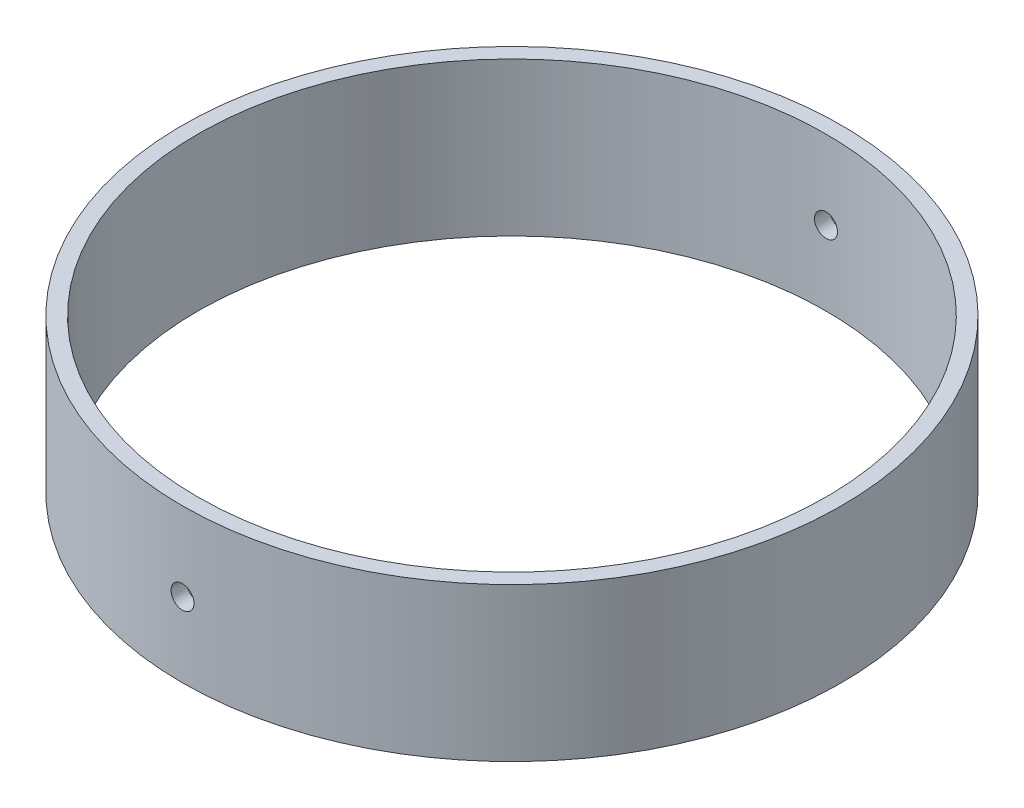
ISO-10303-21;
HEADER;
FILE_DESCRIPTION(('STEP AP214'),'2;1');
FILE_NAME('part.step','',(''),(''),'','','');
FILE_SCHEMA(('AUTOMOTIVE_DESIGN { 1 0 10303 214 1 1 1 1 }'));
ENDSEC;
DATA;
#1=APPLICATION_CONTEXT('core data for automotive mechanical design processes');
#2=APPLICATION_PROTOCOL_DEFINITION('international standard','automotive_design',2000,#1);
#3=PRODUCT_CONTEXT('',#1,'mechanical');
#4=PRODUCT('Part','Part','',(#3));
#5=PRODUCT_RELATED_PRODUCT_CATEGORY('part','',(#4));
#6=PRODUCT_DEFINITION_FORMATION('','',#4);
#7=PRODUCT_DEFINITION_CONTEXT('part definition',#1,'design');
#8=PRODUCT_DEFINITION('design','',#6,#7);
#9=PRODUCT_DEFINITION_SHAPE('','',#8);
#10=(LENGTH_UNIT() NAMED_UNIT(*) SI_UNIT(.MILLI.,.METRE.));
#11=(NAMED_UNIT(*) PLANE_ANGLE_UNIT() SI_UNIT($,.RADIAN.));
#12=(NAMED_UNIT(*) SI_UNIT($,.STERADIAN.) SOLID_ANGLE_UNIT());
#13=UNCERTAINTY_MEASURE_WITH_UNIT(LENGTH_MEASURE(1.E-05),#10,'distance_accuracy_value','');
#14=(GEOMETRIC_REPRESENTATION_CONTEXT(3) GLOBAL_UNCERTAINTY_ASSIGNED_CONTEXT((#13)) GLOBAL_UNIT_ASSIGNED_CONTEXT((#10,
#11,#12)) REPRESENTATION_CONTEXT('',''));
#15=CARTESIAN_POINT('',(0.,0.,0.));
#16=DIRECTION('',(0.,0.,1.));
#17=DIRECTION('',(1.,0.,0.));
#18=AXIS2_PLACEMENT_3D('',#15,#16,#17);
#19=CARTESIAN_POINT('',(0.,25.4,0.));
#20=DIRECTION('',(0.,-1.,0.));
#21=DIRECTION('',(0.,0.,-1.));
#22=AXIS2_PLACEMENT_3D('',#19,#20,#21);
#23=CYLINDRICAL_SURFACE('',#22,54.61);
#24=CARTESIAN_POINT('',(0.,25.4,0.));
#25=DIRECTION('',(0.,1.,0.));
#26=DIRECTION('',(0.,0.,1.));
#27=AXIS2_PLACEMENT_3D('',#24,#25,#26);
#28=CIRCLE('',#27,54.61);
#29=CARTESIAN_POINT('',(0.,25.4,54.61));
#30=VERTEX_POINT('',#29);
#31=EDGE_CURVE('E10',#30,#30,#28,.T.);
#32=ORIENTED_EDGE('',*,*,#31,.F.);
#33=EDGE_LOOP('',(#32));
#34=FACE_BOUND('',#33,.T.);
#35=CARTESIAN_POINT('',(0.,0.,0.));
#36=DIRECTION('',(0.,1.,0.));
#37=DIRECTION('',(0.,0.,1.));
#38=AXIS2_PLACEMENT_3D('',#35,#36,#37);
#39=CIRCLE('',#38,54.61);
#40=CARTESIAN_POINT('',(0.,0.,54.61));
#41=VERTEX_POINT('',#40);
#42=EDGE_CURVE('E44',#41,#41,#39,.T.);
#43=ORIENTED_EDGE('',*,*,#42,.T.);
#44=EDGE_LOOP('',(#43));
#45=FACE_BOUND('',#44,.T.);
#46=CARTESIAN_POINT('',(0.,10.4239555269859,54.61));
#47=CARTESIAN_POINT('',(0.106969775627343,10.4239602599121,54.6099995529571));
#48=CARTESIAN_POINT('',(0.214016285777394,10.4329956416153,54.6096823316829));
#49=CARTESIAN_POINT('',(0.425158795307455,10.4689128482885,54.608447368905));
#50=CARTESIAN_POINT('',(0.52925112556797,10.4958159334483,54.6075289120296));
#51=CARTESIAN_POINT('',(0.731395950473661,10.5666995988189,54.6051954791821));
#52=CARTESIAN_POINT('',(0.829451396653879,10.6106717556031,54.6037807481497));
#53=CARTESIAN_POINT('',(1.01676171214993,10.7144330998902,54.6006142968803));
#54=CARTESIAN_POINT('',(1.10601870854792,10.7742184515143,54.5988626583965));
#55=CARTESIAN_POINT('',(1.27327623468102,10.9079480611374,54.595218479672));
#56=CARTESIAN_POINT('',(1.35127129184676,10.981899162431,54.5933258716019));
#57=CARTESIAN_POINT('',(1.49374470053449,11.1418485181315,54.5896136565972));
#58=CARTESIAN_POINT('',(1.55822251103852,11.2278472545065,54.5877940525868));
#59=CARTESIAN_POINT('',(1.67184201742921,11.4094739988082,54.5844326497573));
#60=CARTESIAN_POINT('',(1.72098007826895,11.5051042820239,54.5828909168215));
#61=CARTESIAN_POINT('',(1.80250171780979,11.7032633842901,54.580259807431));
#62=CARTESIAN_POINT('',(1.83488537555516,11.8057921707921,54.5791704288421));
#63=CARTESIAN_POINT('',(1.88196623483984,12.0147933143339,54.5775674030549));
#64=CARTESIAN_POINT('',(1.89667068923612,12.1212640357115,54.5770535197666));
#65=CARTESIAN_POINT('',(1.90799809069456,12.3351638303227,54.5766587189544));
#66=CARTESIAN_POINT('',(1.90462112389026,12.4425928989887,54.5767777984151));
#67=CARTESIAN_POINT('',(1.87988764209952,12.6553106574942,54.577635275006));
#68=CARTESIAN_POINT('',(1.85853896320751,12.7606002597038,54.5783734022162));
#69=CARTESIAN_POINT('',(1.79848019551148,12.9661002369379,54.5803853434239));
#70=CARTESIAN_POINT('',(1.75977006150685,13.0663105987378,54.5816591588161));
#71=CARTESIAN_POINT('',(1.66607823603268,13.2588327254405,54.5845991971315));
#72=CARTESIAN_POINT('',(1.6110929564523,13.3511427427972,54.5862655065696));
#73=CARTESIAN_POINT('',(1.48641432024243,13.5252246823535,54.5898026067403));
#74=CARTESIAN_POINT('',(1.4167209160937,13.606996570505,54.5916733981335));
#75=CARTESIAN_POINT('',(1.26456006729128,13.7577266844407,54.5954097769148));
#76=CARTESIAN_POINT('',(1.18208583036259,13.8266780537461,54.5972753609957));
#77=CARTESIAN_POINT('',(1.00672840008933,13.9497570524933,54.6007900626657));
#78=CARTESIAN_POINT('',(0.913845204914098,14.003884679328,54.6024391802168));
#79=CARTESIAN_POINT('',(0.720302624519637,14.0957789618525,54.6053350891605));
#80=CARTESIAN_POINT('',(0.61964313459512,14.1335453971989,54.6065818751347));
#81=CARTESIAN_POINT('',(0.4134070526955,14.1916408455937,54.6085324969699));
#82=CARTESIAN_POINT('',(0.307830478743623,14.2119699225522,54.609236334821));
#83=CARTESIAN_POINT('',(0.0948167356045886,14.2346051735236,54.610021469043));
#84=CARTESIAN_POINT('',(-0.0126194243657498,14.2369208341309,54.6101030930966));
#85=CARTESIAN_POINT('',(-0.226354938776963,14.2234882479484,54.6096354675401));
#86=CARTESIAN_POINT('',(-0.332654295017761,14.2077400297638,54.6090862189291));
#87=CARTESIAN_POINT('',(-0.541072271659497,14.1586345722743,54.6074189526073));
#88=CARTESIAN_POINT('',(-0.643191909265567,14.1252816451613,54.606301074182));
#89=CARTESIAN_POINT('',(-0.840382893964743,14.0419179126559,54.6036224941728));
#90=CARTESIAN_POINT('',(-0.935454221633547,13.9919070613582,54.6020617913684));
#91=CARTESIAN_POINT('',(-1.11589350123285,13.876622705868,54.5986725126272));
#92=CARTESIAN_POINT('',(-1.20125737498798,13.8113428219848,54.5968438248408));
#93=CARTESIAN_POINT('',(-1.35981760983991,13.6673828168347,54.5931250135553));
#94=CARTESIAN_POINT('',(-1.43301393058506,13.5887026511297,54.5912348898524));
#95=CARTESIAN_POINT('',(-1.56519301489747,13.4201348402539,54.5876053454446));
#96=CARTESIAN_POINT('',(-1.62416965425449,13.3302423913148,54.5858659898791));
#97=CARTESIAN_POINT('',(-1.72619338466828,13.1418261826704,54.5827351164865));
#98=CARTESIAN_POINT('',(-1.76924051827669,13.0433024460222,54.5813435977301));
#99=CARTESIAN_POINT('',(-1.83817256143816,12.8404433737013,54.5790657587231));
#100=CARTESIAN_POINT('',(-1.86406142183157,12.7361093818919,54.5781793221794));
#101=CARTESIAN_POINT('',(-1.89795497261171,12.524572480879,54.5770112674852));
#102=CARTESIAN_POINT('',(-1.90595969567723,12.417369576918,54.5767296482294));
#103=CARTESIAN_POINT('',(-1.9038573014907,12.2031991246086,54.5768030222639));
#104=CARTESIAN_POINT('',(-1.89375983430056,12.0962314812794,54.5771576763645));
#105=CARTESIAN_POINT('',(-1.85575956396343,11.8855107461099,54.5784629040581));
#106=CARTESIAN_POINT('',(-1.82785672574385,11.7817576606022,54.579413478825));
#107=CARTESIAN_POINT('',(-1.75503933669187,11.5804081229601,54.58180333285));
#108=CARTESIAN_POINT('',(-1.7101245230023,11.4828117659826,54.5832426196594));
#109=CARTESIAN_POINT('',(-1.6045608055315,11.2965463414836,54.5864475932976));
#110=CARTESIAN_POINT('',(-1.54391245361031,11.2078769609965,54.5882132686775));
#111=CARTESIAN_POINT('',(-1.40857232251474,11.0419365764004,54.5918729816849));
#112=CARTESIAN_POINT('',(-1.33387456925283,10.9646704462181,54.5937670736977));
#113=CARTESIAN_POINT('',(-1.17254589656414,10.8237534674585,54.5974700126265));
#114=CARTESIAN_POINT('',(-1.08591203075166,10.7601059905303,54.5992788383464));
#115=CARTESIAN_POINT('',(-0.903129764902133,10.6482185131034,54.6026081084077));
#116=CARTESIAN_POINT('',(-0.806974662675166,10.5999894683916,54.6041283473794));
#117=CARTESIAN_POINT('',(-0.608000477464156,10.5204160522017,54.6067055723962));
#118=CARTESIAN_POINT('',(-0.505189490476256,10.4890515840214,54.6077631095393));
#119=CARTESIAN_POINT('',(-0.334775953220498,10.4523927368054,54.6090137044382));
#120=CARTESIAN_POINT('',(-0.268279082846069,10.4417422400079,54.6093819563875));
#121=CARTESIAN_POINT('',(-0.134531593647159,10.4275221480815,54.6098752447082));
#122=CARTESIAN_POINT('',(-0.0672809751254226,10.4239525501087,54.6100002811774));
#123=CARTESIAN_POINT('',(0.,10.4239555269859,54.61));
#124=B_SPLINE_CURVE_WITH_KNOTS('',3,(#46,#47,#48,#49,#50,#51,#52,#53,#54,#55,#56,#57,#58,#59,
#60,#61,#62,#63,#64,#65,#66,#67,#68,#69,#70,#71,#72,#73,#74,#75,#76,#77,#78,#79,#80,#81,#82,#83,
#84,#85,#86,#87,#88,#89,#90,#91,#92,#93,#94,#95,#96,#97,#98,#99,#100,#101,#102,#103,#104,#105,
#106,#107,#108,#109,#110,#111,#112,#113,#114,#115,#116,#117,#118,#119,#120,#121,#122,#123),
.UNSPECIFIED.,.T.,.F.,(4,2,2,2,2,2,2,2,2,2,2,2,2,2,2,2,2,2,2,2,2,2,2,2,2,2,2,2,2,2,2,2,2,2,2,2,
2,2,4),(0.,0.320663739375775,0.641709711141668,0.962597450739142,1.28340742240517,
1.60437276595062,1.92535095344858,2.2464051452273,2.5674578223161,2.88837874321022,
3.2092981353511,3.53007767142806,3.85085804266061,4.17170918769463,4.49256136935549,
4.81358465392159,5.13460799494749,5.45563565920209,5.77666214684486,6.09751955748752,
6.41837646003512,6.73915480661652,7.05993403719196,7.38084753556984,7.70176209818219,
8.02281462813049,8.34386630046197,8.66484402217062,8.98582115737217,9.30662723436537,
9.62743394327668,9.94824560927158,10.2690460241921,10.5899831595582,10.9109996594955,
11.2322437578877,11.5531041919902,11.7547927307502,11.9564811885042),.UNSPECIFIED.);
#125=CARTESIAN_POINT('',(0.,10.4239555269859,54.61));
#126=VERTEX_POINT('',#125);
#127=EDGE_CURVE('E60',#126,#126,#124,.T.);
#128=ORIENTED_EDGE('',*,*,#127,.F.);
#129=EDGE_LOOP('',(#128));
#130=FACE_BOUND('',#129,.T.);
#131=CARTESIAN_POINT('',(0.,14.2339555269859,-54.61));
#132=CARTESIAN_POINT('',(0.106969775627343,14.2339507940597,-54.6099995529571));
#133=CARTESIAN_POINT('',(0.214016285777394,14.2249154123566,-54.6096823316829));
#134=CARTESIAN_POINT('',(0.425158795307455,14.1889982056833,-54.608447368905));
#135=CARTESIAN_POINT('',(0.52925112556797,14.1620951205235,-54.6075289120296));
#136=CARTESIAN_POINT('',(0.731395950473661,14.091211455153,-54.6051954791821));
#137=CARTESIAN_POINT('',(0.829451396653879,14.0472392983688,-54.6037807481497));
#138=CARTESIAN_POINT('',(1.01676171214993,13.9434779540817,-54.6006142968803));
#139=CARTESIAN_POINT('',(1.10601870854792,13.8836926024576,-54.5988626583965));
#140=CARTESIAN_POINT('',(1.27327623468102,13.7499629928345,-54.595218479672));
#141=CARTESIAN_POINT('',(1.35127129184676,13.6760118915409,-54.5933258716019));
#142=CARTESIAN_POINT('',(1.49374470053449,13.5160625358404,-54.5896136565972));
#143=CARTESIAN_POINT('',(1.55822251103852,13.4300637994654,-54.5877940525868));
#144=CARTESIAN_POINT('',(1.67184201742921,13.2484370551637,-54.5844326497573));
#145=CARTESIAN_POINT('',(1.72098007826894,13.152806771948,-54.5828909168215));
#146=CARTESIAN_POINT('',(1.80250171780979,12.9546476696817,-54.580259807431));
#147=CARTESIAN_POINT('',(1.83488537555516,12.8521188831798,-54.5791704288421));
#148=CARTESIAN_POINT('',(1.88196623483984,12.643117739638,-54.5775674030549));
#149=CARTESIAN_POINT('',(1.89667068923612,12.5366470182604,-54.5770535197666));
#150=CARTESIAN_POINT('',(1.90799809069456,12.3227472236492,-54.5766587189544));
#151=CARTESIAN_POINT('',(1.90462112389026,12.2153181549832,-54.5767777984151));
#152=CARTESIAN_POINT('',(1.87988764209952,12.0026003964777,-54.577635275006));
#153=CARTESIAN_POINT('',(1.85853896320751,11.8973107942681,-54.5783734022162));
#154=CARTESIAN_POINT('',(1.79848019551148,11.691810817034,-54.5803853434239));
#155=CARTESIAN_POINT('',(1.75977006150685,11.5916004552341,-54.5816591588161));
#156=CARTESIAN_POINT('',(1.66607823603268,11.3990783285314,-54.5845991971315));
#157=CARTESIAN_POINT('',(1.6110929564523,11.3067683111747,-54.5862655065696));
#158=CARTESIAN_POINT('',(1.48641432024243,11.1326863716184,-54.5898026067403));
#159=CARTESIAN_POINT('',(1.4167209160937,11.0509144834669,-54.5916733981335));
#160=CARTESIAN_POINT('',(1.26456006729128,10.9001843695312,-54.5954097769148));
#161=CARTESIAN_POINT('',(1.18208583036259,10.8312330002258,-54.5972753609957));
#162=CARTESIAN_POINT('',(1.00672840008933,10.7081540014785,-54.6007900626657));
#163=CARTESIAN_POINT('',(0.913845204914098,10.6540263746438,-54.6024391802168));
#164=CARTESIAN_POINT('',(0.720302624519637,10.5621320921194,-54.6053350891605));
#165=CARTESIAN_POINT('',(0.61964313459512,10.524365656773,-54.6065818751347));
#166=CARTESIAN_POINT('',(0.4134070526955,10.4662702083782,-54.6085324969699));
#167=CARTESIAN_POINT('',(0.307830478743623,10.4459411314197,-54.609236334821));
#168=CARTESIAN_POINT('',(0.0948167356045886,10.4233058804483,-54.610021469043));
#169=CARTESIAN_POINT('',(-0.0126194243657498,10.420990219841,-54.6101030930966));
#170=CARTESIAN_POINT('',(-0.226354938776963,10.4344228060235,-54.6096354675401));
#171=CARTESIAN_POINT('',(-0.332654295017761,10.4501710242081,-54.6090862189291));
#172=CARTESIAN_POINT('',(-0.541072271659497,10.4992764816976,-54.6074189526073));
#173=CARTESIAN_POINT('',(-0.643191909265566,10.5326294088106,-54.606301074182));
#174=CARTESIAN_POINT('',(-0.840382893964743,10.615993141316,-54.6036224941728));
#175=CARTESIAN_POINT('',(-0.935454221633546,10.6660039926136,-54.6020617913684));
#176=CARTESIAN_POINT('',(-1.11589350123285,10.7812883481038,-54.5986725126272));
#177=CARTESIAN_POINT('',(-1.20125737498798,10.846568231987,-54.5968438248408));
#178=CARTESIAN_POINT('',(-1.35981760983991,10.9905282371372,-54.5931250135553));
#179=CARTESIAN_POINT('',(-1.43301393058506,11.0692084028422,-54.5912348898524));
#180=CARTESIAN_POINT('',(-1.56519301489747,11.237776213718,-54.5876053454446));
#181=CARTESIAN_POINT('',(-1.62416965425449,11.3276686626571,-54.5858659898791));
#182=CARTESIAN_POINT('',(-1.72619338466828,11.5160848713015,-54.5827351164865));
#183=CARTESIAN_POINT('',(-1.76924051827669,11.6146086079496,-54.5813435977301));
#184=CARTESIAN_POINT('',(-1.83817256143816,11.8174676802706,-54.5790657587231));
#185=CARTESIAN_POINT('',(-1.86406142183157,11.9218016720799,-54.5781793221794));
#186=CARTESIAN_POINT('',(-1.89795497261171,12.1333385730929,-54.5770112674852));
#187=CARTESIAN_POINT('',(-1.90595969567723,12.2405414770539,-54.5767296482294));
#188=CARTESIAN_POINT('',(-1.9038573014907,12.4547119293633,-54.5768030222639));
#189=CARTESIAN_POINT('',(-1.89375983430056,12.5616795726925,-54.5771576763645));
#190=CARTESIAN_POINT('',(-1.85575956396343,12.7724003078619,-54.5784629040581));
#191=CARTESIAN_POINT('',(-1.82785672574385,12.8761533933697,-54.579413478825));
#192=CARTESIAN_POINT('',(-1.75503933669187,13.0775029310117,-54.58180333285));
#193=CARTESIAN_POINT('',(-1.7101245230023,13.1750992879893,-54.5832426196594));
#194=CARTESIAN_POINT('',(-1.6045608055315,13.3613647124883,-54.5864475932976));
#195=CARTESIAN_POINT('',(-1.54391245361031,13.4500340929754,-54.5882132686775));
#196=CARTESIAN_POINT('',(-1.40857232251474,13.6159744775715,-54.5918729816849));
#197=CARTESIAN_POINT('',(-1.33387456925283,13.6932406077538,-54.5937670736977));
#198=CARTESIAN_POINT('',(-1.17254589656414,13.8341575865134,-54.5974700126265));
#199=CARTESIAN_POINT('',(-1.08591203075166,13.8978050634416,-54.5992788383464));
#200=CARTESIAN_POINT('',(-0.903129764902133,14.0096925408685,-54.6026081084077));
#201=CARTESIAN_POINT('',(-0.806974662675166,14.0579215855802,-54.6041283473794));
#202=CARTESIAN_POINT('',(-0.608000477464156,14.1374950017702,-54.6067055723962));
#203=CARTESIAN_POINT('',(-0.505189490476256,14.1688594699505,-54.6077631095393));
#204=CARTESIAN_POINT('',(-0.334775953220498,14.2055183171664,-54.6090137044382));
#205=CARTESIAN_POINT('',(-0.268279082846069,14.216168813964,-54.6093819563875));
#206=CARTESIAN_POINT('',(-0.134531593647158,14.2303889058904,-54.6098752447082));
#207=CARTESIAN_POINT('',(-0.0672809751254226,14.2339585038632,-54.6100002811774));
#208=CARTESIAN_POINT('',(0.,14.2339555269859,-54.61));
#209=B_SPLINE_CURVE_WITH_KNOTS('',3,(#131,#132,#133,#134,#135,#136,#137,#138,#139,#140,#141,
#142,#143,#144,#145,#146,#147,#148,#149,#150,#151,#152,#153,#154,#155,#156,#157,#158,#159,#160,
#161,#162,#163,#164,#165,#166,#167,#168,#169,#170,#171,#172,#173,#174,#175,#176,#177,#178,#179,
#180,#181,#182,#183,#184,#185,#186,#187,#188,#189,#190,#191,#192,#193,#194,#195,#196,#197,#198,
#199,#200,#201,#202,#203,#204,#205,#206,#207,#208),.UNSPECIFIED.,.T.,.F.,(4,2,2,2,2,2,2,2,2,2,2,
2,2,2,2,2,2,2,2,2,2,2,2,2,2,2,2,2,2,2,2,2,2,2,2,2,2,2,4),(0.,0.320663739375775,
0.641709711141668,0.962597450739142,1.28340742240517,1.60437276595063,1.92535095344858,
2.2464051452273,2.5674578223161,2.88837874321022,3.2092981353511,3.53007767142806,
3.85085804266061,4.17170918769463,4.49256136935549,4.81358465392159,5.13460799494749,
5.45563565920209,5.77666214684486,6.09751955748752,6.41837646003512,6.73915480661652,
7.05993403719196,7.38084753556984,7.70176209818219,8.0228146281305,8.34386630046197,
8.66484402217062,8.98582115737217,9.30662723436537,9.62743394327668,9.94824560927158,
10.2690460241921,10.5899831595582,10.9109996594955,11.2322437578877,11.5531041919903,
11.7547927307502,11.9564811885042),.UNSPECIFIED.);
#210=CARTESIAN_POINT('',(0.,14.2339555269859,-54.61));
#211=VERTEX_POINT('',#210);
#212=EDGE_CURVE('E61',#211,#211,#209,.T.);
#213=ORIENTED_EDGE('',*,*,#212,.F.);
#214=EDGE_LOOP('',(#213));
#215=FACE_BOUND('',#214,.T.);
#216=ADVANCED_FACE('F31',(#34,#45,#130,#215),#23,.T.);
#217=CARTESIAN_POINT('',(0.,25.4,0.));
#218=DIRECTION('',(0.,-1.,0.));
#219=DIRECTION('',(0.,0.,-1.));
#220=AXIS2_PLACEMENT_3D('',#217,#218,#219);
#221=CYLINDRICAL_SURFACE('',#220,52.07);
#222=CARTESIAN_POINT('',(-1.905,12.3289555269859,52.0351407704447));
#223=CARTESIAN_POINT('',(-1.90499526830546,12.2219892655447,52.0351412402369));
#224=CARTESIAN_POINT('',(-1.89596047776962,12.1149463548565,52.0354741425041));
#225=CARTESIAN_POINT('',(-1.86004575671715,11.9038111870525,52.0367700787376));
#226=CARTESIAN_POINT('',(-1.83314458953048,11.7997225952704,52.0377338625746));
#227=CARTESIAN_POINT('',(-1.76226631970125,11.5975852691021,52.0401822407015));
#228=CARTESIAN_POINT('',(-1.71829766698883,11.4995335737015,52.0416665772362));
#229=CARTESIAN_POINT('',(-1.61454489288832,11.3122300130282,52.0449884774772));
#230=CARTESIAN_POINT('',(-1.55476459724002,11.2229760262482,52.0468259557089));
#231=CARTESIAN_POINT('',(-1.42104379024546,11.0557199379436,52.0506483865065));
#232=CARTESIAN_POINT('',(-1.34709589194841,10.9777237435643,52.0526334156731));
#233=CARTESIAN_POINT('',(-1.18715273755405,10.8352472611447,52.0565265266392));
#234=CARTESIAN_POINT('',(-1.10115699866338,10.7707675150079,52.0584346053511));
#235=CARTESIAN_POINT('',(-0.91953325932436,10.6571418544453,52.0619592225406));
#236=CARTESIAN_POINT('',(-0.823902741629071,10.607999961104,52.0635756845191));
#237=CARTESIAN_POINT('',(-0.625741884410336,10.5264709474708,52.0663341899283));
#238=CARTESIAN_POINT('',(-0.523211579273002,10.4940837436864,52.0674762357231));
#239=CARTESIAN_POINT('',(-0.314210640546689,10.4469974745115,52.0691567232569));
#240=CARTESIAN_POINT('',(-0.207741807262072,10.432290428018,52.0696954373418));
#241=CARTESIAN_POINT('',(0.00615477994340771,10.4209573464483,52.0701094533458));
#242=CARTESIAN_POINT('',(0.113582529015595,10.4243312199992,52.0699847586174));
#243=CARTESIAN_POINT('',(0.326293418097942,10.4490575188441,52.0690862433391));
#244=CARTESIAN_POINT('',(0.431577559766158,10.4704013401045,52.0683127334432));
#245=CARTESIAN_POINT('',(0.637067430308371,10.5304483409631,52.0662041084118));
#246=CARTESIAN_POINT('',(0.737273145225021,10.5691515682683,52.0648689917328));
#247=CARTESIAN_POINT('',(0.929789399866694,10.6628285944799,52.0617870694151));
#248=CARTESIAN_POINT('',(1.0220980222654,10.7178063302868,52.0600401641831));
#249=CARTESIAN_POINT('',(1.19617878841137,10.8424688523771,52.0563314975162));
#250=CARTESIAN_POINT('',(1.27795089427642,10.912153691535,52.0543697353088));
#251=CARTESIAN_POINT('',(1.42868757684808,11.0643010061826,52.0504510378179));
#252=CARTESIAN_POINT('',(1.49764461957624,11.1467709461129,52.0484941060369));
#253=CARTESIAN_POINT('',(1.62073572688196,11.3221211461268,52.0448068504914));
#254=CARTESIAN_POINT('',(1.67486978868543,11.4150014081587,52.0430765267693));
#255=CARTESIAN_POINT('',(1.76677749238383,11.6085400448021,52.0400376848695));
#256=CARTESIAN_POINT('',(1.80455087927111,11.7091985406211,52.0387291732666));
#257=CARTESIAN_POINT('',(1.86266008507773,11.9154343596281,52.0366817736014));
#258=CARTESIAN_POINT('',(1.88299597439383,12.0210116629565,52.0359428832394));
#259=CARTESIAN_POINT('',(1.90564365895596,12.2340225705945,52.0351184629643));
#260=CARTESIAN_POINT('',(1.90796589725788,12.3414550631815,52.0350325544984));
#261=CARTESIAN_POINT('',(1.89454758460457,12.5551843306548,52.0355227973308));
#262=CARTESIAN_POINT('',(1.87880706519658,12.6614811075243,52.0360989474728));
#263=CARTESIAN_POINT('',(1.82971870561021,12.8698923715448,52.037848016264));
#264=CARTESIAN_POINT('',(1.79637562064544,12.972007980186,52.0390207737407));
#265=CARTESIAN_POINT('',(1.71303343659757,13.1691926843952,52.0418307220251));
#266=CARTESIAN_POINT('',(1.66303428669963,13.2642617584644,52.0434679142498));
#267=CARTESIAN_POINT('',(1.54777238067686,13.4447028167908,52.0470231045449));
#268=CARTESIAN_POINT('',(1.48250259593506,13.5300703087363,52.0489412317688));
#269=CARTESIAN_POINT('',(1.33856249602039,13.6886397898603,52.0528416144255));
#270=CARTESIAN_POINT('',(1.25989213257514,13.7618417352136,52.0548238700893));
#271=CARTESIAN_POINT('',(1.0913392762083,13.8940371079189,52.0586301637248));
#272=CARTESIAN_POINT('',(1.00145149767171,13.9530237984203,52.0604541264177));
#273=CARTESIAN_POINT('',(0.813042278677641,14.0550681962755,52.06373716619));
#274=CARTESIAN_POINT('',(0.714520862667973,14.0981259487335,52.0651962443025));
#275=CARTESIAN_POINT('',(0.511666337437637,14.1670784050759,52.0675846892501));
#276=CARTESIAN_POINT('',(0.40733470816635,14.1929774580612,52.0685141903051));
#277=CARTESIAN_POINT('',(0.195800466864161,14.2268915915084,52.0697392421445));
#278=CARTESIAN_POINT('',(0.0885978610955468,14.2349067109761,52.0700347943116));
#279=CARTESIAN_POINT('',(-0.125568094570424,14.2328249694414,52.0699586433936));
#280=CARTESIAN_POINT('',(-0.232531547765919,14.2227387045234,52.069587330674));
#281=CARTESIAN_POINT('',(-0.443245714490134,14.1847623392764,52.0682200453809));
#282=CARTESIAN_POINT('',(-0.546996421727213,14.1568722040838,52.0672240715841));
#283=CARTESIAN_POINT('',(-0.748343202323639,14.0840815873349,52.0647196116998));
#284=CARTESIAN_POINT('',(-0.845939184018161,14.0391808525026,52.0632111179813));
#285=CARTESIAN_POINT('',(-1.03220645151803,13.9336463349088,52.0598515001394));
#286=CARTESIAN_POINT('',(-1.12087804651311,13.873013097468,52.0580003878925));
#287=CARTESIAN_POINT('',(-1.28683033895055,13.7377000720801,52.0541628801186));
#288=CARTESIAN_POINT('',(-1.3641055676894,13.6630135793539,52.0521764203072));
#289=CARTESIAN_POINT('',(-1.50504276040354,13.5017057782561,52.0482923004433));
#290=CARTESIAN_POINT('',(-1.56870135480403,13.4150815244638,52.0463946624612));
#291=CARTESIAN_POINT('',(-1.68061423319673,13.2323139409058,52.0429013685273));
#292=CARTESIAN_POINT('',(-1.72885719374613,13.1361636814844,52.0413059349062));
#293=CARTESIAN_POINT('',(-1.80845889199168,12.9371960488547,52.0386008433357));
#294=CARTESIAN_POINT('',(-1.83983771148121,12.8343867694754,52.0374906079088));
#295=CARTESIAN_POINT('',(-1.8765279407455,12.6639350379527,52.0361771173531));
#296=CARTESIAN_POINT('',(-1.88719147463338,12.5973983445768,52.0357901826481));
#297=CARTESIAN_POINT('',(-1.9014289916999,12.463569730275,52.0352718614121));
#298=CARTESIAN_POINT('',(-1.90500297802759,12.3962778096846,52.0351404747675));
#299=CARTESIAN_POINT('',(-1.905,12.3289555269859,52.0351407704447));
#300=B_SPLINE_CURVE_WITH_KNOTS('',3,(#222,#223,#224,#225,#226,#227,#228,#229,#230,#231,#232,
#233,#234,#235,#236,#237,#238,#239,#240,#241,#242,#243,#244,#245,#246,#247,#248,#249,#250,#251,
#252,#253,#254,#255,#256,#257,#258,#259,#260,#261,#262,#263,#264,#265,#266,#267,#268,#269,#270,
#271,#272,#273,#274,#275,#276,#277,#278,#279,#280,#281,#282,#283,#284,#285,#286,#287,#288,#289,
#290,#291,#292,#293,#294,#295,#296,#297,#298,#299),.UNSPECIFIED.,.T.,.F.,(4,2,2,2,2,2,2,2,2,2,2,
2,2,2,2,2,2,2,2,2,2,2,2,2,2,2,2,2,2,2,2,2,2,2,2,2,2,2,4),(0.,0.320653044565309,0.641687913578,
0.962564043952039,1.28336260696718,1.6043288909612,1.92530804072469,2.24637127020162,
2.56743289973083,2.88834954246614,3.20926456343227,3.5300260172059,3.85078835249985,
4.17162834561096,4.4924694922139,4.8134986687892,5.13452790544415,5.45556214568053,
5.7765950898667,6.09744190766938,6.41828816510273,6.73904779241612,7.05980839832186,
7.38071693220773,7.70162662211441,8.02268809880658,8.34374866638031,8.66472782571347,
8.98570628497118,9.30649691298319,9.62728816917163,9.94808420190655,10.2688691166779,
10.5898074671157,10.9108251453705,11.232078085674,11.5529476260584,11.7547599004356,
11.9565720851709),.UNSPECIFIED.);
#301=CARTESIAN_POINT('',(-1.905,12.3289555269859,52.0351407704447));
#302=VERTEX_POINT('',#301);
#303=EDGE_CURVE('E54',#302,#302,#300,.T.);
#304=ORIENTED_EDGE('',*,*,#303,.T.);
#305=EDGE_LOOP('',(#304));
#306=FACE_BOUND('',#305,.T.);
#307=CARTESIAN_POINT('',(0.,25.4,0.));
#308=DIRECTION('',(0.,1.,0.));
#309=DIRECTION('',(0.,0.,1.));
#310=AXIS2_PLACEMENT_3D('',#307,#308,#309);
#311=CIRCLE('',#310,52.07);
#312=CARTESIAN_POINT('',(0.,25.4,52.07));
#313=VERTEX_POINT('',#312);
#314=EDGE_CURVE('E49',#313,#313,#311,.T.);
#315=ORIENTED_EDGE('',*,*,#314,.T.);
#316=EDGE_LOOP('',(#315));
#317=FACE_BOUND('',#316,.T.);
#318=CARTESIAN_POINT('',(0.,0.,0.));
#319=DIRECTION('',(0.,1.,0.));
#320=DIRECTION('',(0.,0.,1.));
#321=AXIS2_PLACEMENT_3D('',#318,#319,#320);
#322=CIRCLE('',#321,52.07);
#323=CARTESIAN_POINT('',(0.,0.,52.07));
#324=VERTEX_POINT('',#323);
#325=EDGE_CURVE('E52',#324,#324,#322,.T.);
#326=ORIENTED_EDGE('',*,*,#325,.F.);
#327=EDGE_LOOP('',(#326));
#328=FACE_BOUND('',#327,.T.);
#329=CARTESIAN_POINT('',(0.,14.2339555269859,-52.07));
#330=CARTESIAN_POINT('',(0.106966288458441,14.233950795316,-52.0699995313963));
#331=CARTESIAN_POINT('',(0.214009226071014,14.2249160003706,-52.0696668578302));
#332=CARTESIAN_POINT('',(0.425144449819147,14.1890012602098,-52.0683717383388));
#333=CARTESIAN_POINT('',(0.529233070642106,14.1621000784155,-52.067408542974));
#334=CARTESIAN_POINT('',(0.731370458195049,14.0912217658463,-52.0649614422721));
#335=CARTESIAN_POINT('',(0.829422185693344,14.0472530843043,-52.0634777946187));
#336=CARTESIAN_POINT('',(1.01672580005476,13.9435002423309,-52.0601570709046));
#337=CARTESIAN_POINT('',(1.10597980846589,13.8837199077111,-52.0583200803686));
#338=CARTESIAN_POINT('',(1.27323587196615,13.7499990615077,-52.0544982119107));
#339=CARTESIAN_POINT('',(1.351232026852,13.6760511716641,-52.0525132572619));
#340=CARTESIAN_POINT('',(1.4937084331566,13.5161080507082,-52.0486198479751));
#341=CARTESIAN_POINT('',(1.55818814255089,13.4301123366955,-52.0467113964076));
#342=CARTESIAN_POINT('',(1.67181376498669,13.2484886187769,-52.043185748724));
#343=CARTESIAN_POINT('',(1.72095565011314,13.1528580933497,-52.0415686291627));
#344=CARTESIAN_POINT('',(1.80248464642008,12.954697219317,-52.0388088129371));
#345=CARTESIAN_POINT('',(1.83487184119302,12.8521669051388,-52.0376661139058));
#346=CARTESIAN_POINT('',(1.88195809110012,12.6431659402601,-52.0359846111895));
#347=CARTESIAN_POINT('',(1.89666512669891,12.5366970897216,-52.0354455350489));
#348=CARTESIAN_POINT('',(1.90799818050259,12.3228004688466,-52.0350312445709));
#349=CARTESIAN_POINT('',(1.90462429019504,12.2153727033648,-52.0351560268743));
#350=CARTESIAN_POINT('',(1.87989796513964,12.0026618890389,-52.0360551282865));
#351=CARTESIAN_POINT('',(1.85855415128467,11.8973778365706,-52.0368291359352));
#352=CARTESIAN_POINT('',(1.79850719628129,11.6918881406151,-52.038938948265));
#353=CARTESIAN_POINT('',(1.75980400726118,11.5916825111335,-52.0402747544954));
#354=CARTESIAN_POINT('',(1.66612705965854,11.3991663588134,-52.0433579469025));
#355=CARTESIAN_POINT('',(1.61114935513346,11.3068577577046,-52.0451054328745));
#356=CARTESIAN_POINT('',(1.48648689945445,11.1327770208085,-52.0488148970155));
#357=CARTESIAN_POINT('',(1.41680209544616,11.051004922889,-52.0507768759552));
#358=CARTESIAN_POINT('',(1.26465480534138,10.9002681994241,-52.0546955492486));
#359=CARTESIAN_POINT('',(1.18218484772912,10.8313111149874,-52.0566522398272));
#360=CARTESIAN_POINT('',(1.00683459761942,10.7082199320119,-52.0603386592262));
#361=CARTESIAN_POINT('',(0.913954303232206,10.6540858361639,-52.0620683880054));
#362=CARTESIAN_POINT('',(0.720415658660604,10.5621781081143,-52.0651059462064));
#363=CARTESIAN_POINT('',(0.619757192334095,10.5244047202633,-52.0664137693268));
#364=CARTESIAN_POINT('',(0.413521437305859,10.4662955034549,-52.0684600015425));
#365=CARTESIAN_POINT('',(0.307944168414538,10.4459596042747,-52.0691984129309));
#366=CARTESIAN_POINT('',(0.0949332754570125,10.4233118826449,-52.0700222955625));
#367=CARTESIAN_POINT('',(-0.0124992378872404,10.4209896265374,-52.0701081447747));
#368=CARTESIAN_POINT('',(-0.226228551181661,10.4344079109922,-52.0696182282228));
#369=CARTESIAN_POINT('',(-0.332525353115192,10.4501484200052,-52.0690424636143));
#370=CARTESIAN_POINT('',(-0.540936735047739,10.4992367838029,-52.0672944413197));
#371=CARTESIAN_POINT('',(-0.643052434065032,10.5325798938455,-52.0661223443766));
#372=CARTESIAN_POINT('',(-0.840237307894198,10.6159221583999,-52.063313702997));
#373=CARTESIAN_POINT('',(-0.935306461269123,10.6659213635802,-52.0616771571477));
#374=CARTESIAN_POINT('',(-1.11574757156195,10.7811833497919,-52.05812296448));
#375=CARTESIAN_POINT('',(-1.2011150451561,10.8464531453714,-52.0562051886301));
#376=CARTESIAN_POINT('',(-1.35968448418793,10.9903932566452,-52.052305058027));
#377=CARTESIAN_POINT('',(-1.43288640572231,11.0690636206977,-52.0503227030407));
#378=CARTESIAN_POINT('',(-1.56508172989893,11.2376164662498,-52.0465158035708));
#379=CARTESIAN_POINT('',(-1.62406839571585,11.3275042333385,-52.044691334173));
#380=CARTESIAN_POINT('',(-1.72611275019646,11.5159134231325,-52.0414070954584));
#381=CARTESIAN_POINT('',(-1.76917048396401,11.6144348213901,-52.039947325109));
#382=CARTESIAN_POINT('',(-1.83812292727873,11.817289360218,-52.0375576134749));
#383=CARTESIAN_POINT('',(-1.86402197784815,11.9216210235869,-52.0366275381896));
#384=CARTESIAN_POINT('',(-1.89793609489923,12.1331553365634,-52.035401708275));
#385=CARTESIAN_POINT('',(-1.90595120056706,12.2403579798798,-52.0351059522559));
#386=CARTESIAN_POINT('',(-1.90386942003916,12.4545239094813,-52.0351821555379));
#387=CARTESIAN_POINT('',(-1.89378314631907,12.5614872992269,-52.0355537236004));
#388=CARTESIAN_POINT('',(-1.85580678584909,12.7722013369296,-52.0369218660373));
#389=CARTESIAN_POINT('',(-1.82791666412144,12.8759519785746,-52.0379184416396));
#390=CARTESIAN_POINT('',(-1.7551260976448,13.0772986321779,-52.0404241881654));
#391=CARTESIAN_POINT('',(-1.71022539956732,13.1748945524523,-52.0419333667228));
#392=CARTESIAN_POINT('',(-1.60469097439165,13.3611617125403,-52.0452941372021));
#393=CARTESIAN_POINT('',(-1.54405779254818,13.449833261506,-52.0471457172564));
#394=CARTESIAN_POINT('',(-1.40874482690857,13.615785559975,-52.0509837408622));
#395=CARTESIAN_POINT('',(-1.3340583257209,13.6930608304951,-52.0529702486167));
#396=CARTESIAN_POINT('',(-1.17275049070751,13.8339981035388,-52.0568540214839));
#397=CARTESIAN_POINT('',(-1.08612621155115,13.897656736595,-52.0587512644173));
#398=CARTESIAN_POINT('',(-0.903358608767621,14.0095696550022,-52.062243497188));
#399=CARTESIAN_POINT('',(-0.807208359991523,14.0578126242816,-52.0638382646417));
#400=CARTESIAN_POINT('',(-0.608240750211248,14.1374143418297,-52.0665420473324));
#401=CARTESIAN_POINT('',(-0.5054314829775,14.1687931717524,-52.067651640016));
#402=CARTESIAN_POINT('',(-0.334979723388497,14.2054834314285,-52.0689643297786));
#403=CARTESIAN_POINT('',(-0.268442987653541,14.2161469789708,-52.0693510150399));
#404=CARTESIAN_POINT('',(-0.134614288420758,14.2303845141852,-52.0698689975586));
#405=CARTESIAN_POINT('',(-0.0673223252576544,14.2339585049992,-52.0700002949293));
#406=CARTESIAN_POINT('',(0.,14.2339555269859,-52.07));
#407=B_SPLINE_CURVE_WITH_KNOTS('',3,(#329,#330,#331,#332,#333,#334,#335,#336,#337,#338,#339,
#340,#341,#342,#343,#344,#345,#346,#347,#348,#349,#350,#351,#352,#353,#354,#355,#356,#357,#358,
#359,#360,#361,#362,#363,#364,#365,#366,#367,#368,#369,#370,#371,#372,#373,#374,#375,#376,#377,
#378,#379,#380,#381,#382,#383,#384,#385,#386,#387,#388,#389,#390,#391,#392,#393,#394,#395,#396,
#397,#398,#399,#400,#401,#402,#403,#404,#405,#406),.UNSPECIFIED.,.T.,.F.,(4,2,2,2,2,2,2,2,2,2,2,
2,2,2,2,2,2,2,2,2,2,2,2,2,2,2,2,2,2,2,2,2,2,2,2,2,2,2,4),(0.,0.320653125702091,
0.641688074086816,0.962564297008623,1.28336295114703,1.60432912900946,1.92530817551043,
2.24637144455757,2.56743311174164,2.88834980373318,3.20926487192202,3.53002607195279,
3.85078815654788,4.17162807737161,4.4924691512492,4.81349843317854,5.13452777338388,
5.45556190806231,5.77659474989215,6.09744163282921,6.41828795535965,6.73904783859885,
7.05980869761126,7.38071718846682,7.70162683739837,8.02268827251424,8.34374879851571,
8.6647280674868,8.98570663314763,9.30649707698605,9.62728815105742,9.94808400266907,
10.2688687376573,10.5898071968922,10.9108249814306,11.2320778748436,11.5529473710249,
11.7547597728734,11.9565720852805),.UNSPECIFIED.);
#408=CARTESIAN_POINT('',(0.,14.2339555269859,-52.07));
#409=VERTEX_POINT('',#408);
#410=EDGE_CURVE('E35',#409,#409,#407,.T.);
#411=ORIENTED_EDGE('',*,*,#410,.T.);
#412=EDGE_LOOP('',(#411));
#413=FACE_BOUND('',#412,.T.);
#414=ADVANCED_FACE('F62',(#306,#317,#328,#413),#221,.F.);
#415=CARTESIAN_POINT('',(0.,25.4,0.));
#416=DIRECTION('',(0.,1.,0.));
#417=DIRECTION('',(0.,0.,1.));
#418=AXIS2_PLACEMENT_3D('',#415,#416,#417);
#419=PLANE('',#418);
#420=ORIENTED_EDGE('',*,*,#31,.T.);
#421=EDGE_LOOP('',(#420));
#422=FACE_BOUND('',#421,.T.);
#423=ORIENTED_EDGE('',*,*,#314,.F.);
#424=EDGE_LOOP('',(#423));
#425=FACE_BOUND('',#424,.T.);
#426=ADVANCED_FACE('F91',(#422,#425),#419,.T.);
#427=CARTESIAN_POINT('',(0.,0.,0.));
#428=DIRECTION('',(0.,1.,0.));
#429=DIRECTION('',(0.,0.,1.));
#430=AXIS2_PLACEMENT_3D('',#427,#428,#429);
#431=PLANE('',#430);
#432=ORIENTED_EDGE('',*,*,#42,.F.);
#433=EDGE_LOOP('',(#432));
#434=FACE_BOUND('',#433,.T.);
#435=ORIENTED_EDGE('',*,*,#325,.T.);
#436=EDGE_LOOP('',(#435));
#437=FACE_BOUND('',#436,.T.);
#438=ADVANCED_FACE('F69',(#434,#437),#431,.F.);
#439=CARTESIAN_POINT('',(0.,12.3289555269859,54.61));
#440=DIRECTION('',(0.,0.,-1.));
#441=DIRECTION('',(-1.,0.,0.));
#442=AXIS2_PLACEMENT_3D('',#439,#440,#441);
#443=CYLINDRICAL_SURFACE('',#442,1.905);
#444=ORIENTED_EDGE('',*,*,#303,.F.);
#445=EDGE_LOOP('',(#444));
#446=FACE_BOUND('',#445,.T.);
#447=ORIENTED_EDGE('',*,*,#127,.T.);
#448=EDGE_LOOP('',(#447));
#449=FACE_BOUND('',#448,.T.);
#450=ADVANCED_FACE('F65',(#446,#449),#443,.F.);
#451=CARTESIAN_POINT('',(0.,12.3289555269859,-54.61));
#452=DIRECTION('',(0.,0.,1.));
#453=DIRECTION('',(1.,0.,0.));
#454=AXIS2_PLACEMENT_3D('',#451,#452,#453);
#455=CYLINDRICAL_SURFACE('',#454,1.905);
#456=ORIENTED_EDGE('',*,*,#410,.F.);
#457=EDGE_LOOP('',(#456));
#458=FACE_BOUND('',#457,.T.);
#459=ORIENTED_EDGE('',*,*,#212,.T.);
#460=EDGE_LOOP('',(#459));
#461=FACE_BOUND('',#460,.T.);
#462=ADVANCED_FACE('F68',(#458,#461),#455,.F.);
#463=CLOSED_SHELL('',(#216,#414,#426,#438,#450,#462));
#464=MANIFOLD_SOLID_BREP('B2',#463);
#465=ADVANCED_BREP_SHAPE_REPRESENTATION('',(#18,#464),#14);
#466=SHAPE_DEFINITION_REPRESENTATION(#9,#465);
ENDSEC;
END-ISO-10303-21;
